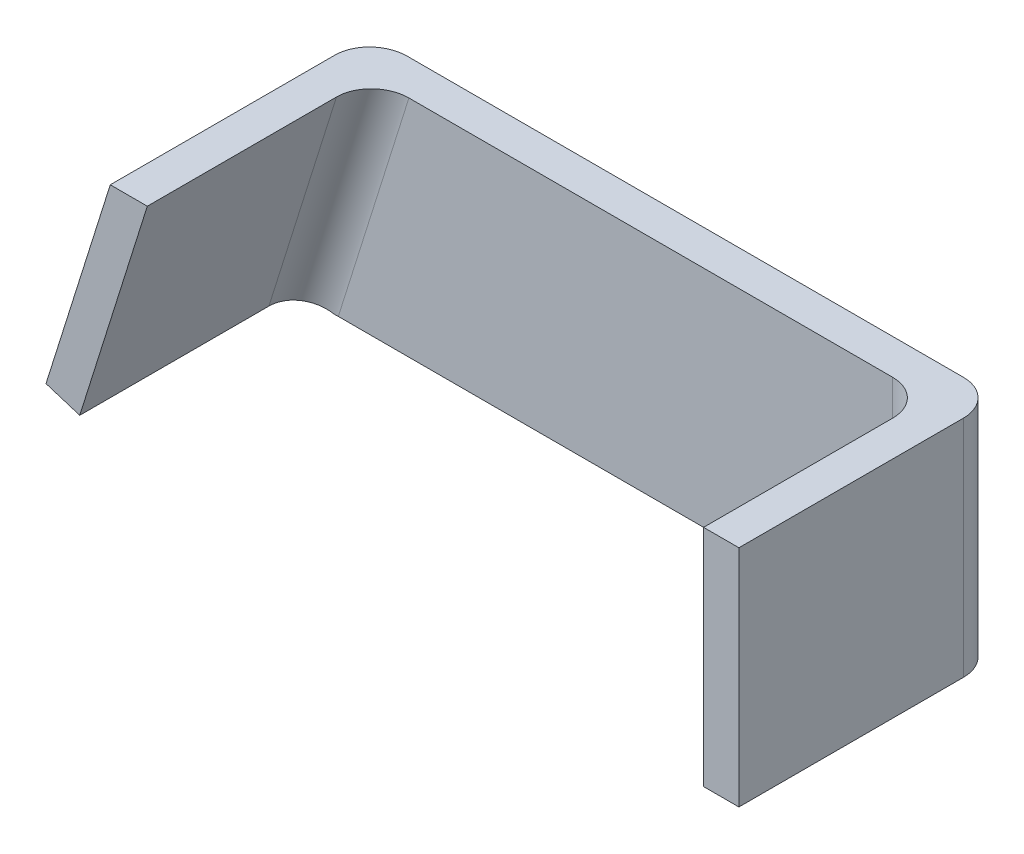
ISO-10303-21;
HEADER;
FILE_DESCRIPTION(('STEP AP214'),'2;1');
FILE_NAME('part.step','',(''),(''),'','','');
FILE_SCHEMA(('AUTOMOTIVE_DESIGN { 1 0 10303 214 1 1 1 1 }'));
ENDSEC;
DATA;
#1=APPLICATION_CONTEXT('core data for automotive mechanical design processes');
#2=APPLICATION_PROTOCOL_DEFINITION('international standard','automotive_design',2000,#1);
#3=PRODUCT_CONTEXT('',#1,'mechanical');
#4=PRODUCT('Part','Part','',(#3));
#5=PRODUCT_RELATED_PRODUCT_CATEGORY('part','',(#4));
#6=PRODUCT_DEFINITION_FORMATION('','',#4);
#7=PRODUCT_DEFINITION_CONTEXT('part definition',#1,'design');
#8=PRODUCT_DEFINITION('design','',#6,#7);
#9=PRODUCT_DEFINITION_SHAPE('','',#8);
#10=(LENGTH_UNIT() NAMED_UNIT(*) SI_UNIT(.MILLI.,.METRE.));
#11=(NAMED_UNIT(*) PLANE_ANGLE_UNIT() SI_UNIT($,.RADIAN.));
#12=(NAMED_UNIT(*) SI_UNIT($,.STERADIAN.) SOLID_ANGLE_UNIT());
#13=UNCERTAINTY_MEASURE_WITH_UNIT(LENGTH_MEASURE(1.E-05),#10,'distance_accuracy_value','');
#14=(GEOMETRIC_REPRESENTATION_CONTEXT(3) GLOBAL_UNCERTAINTY_ASSIGNED_CONTEXT((#13)) GLOBAL_UNIT_ASSIGNED_CONTEXT((#10,
#11,#12)) REPRESENTATION_CONTEXT('',''));
#15=CARTESIAN_POINT('',(0.,0.,0.));
#16=DIRECTION('',(0.,0.,1.));
#17=DIRECTION('',(1.,0.,0.));
#18=AXIS2_PLACEMENT_3D('',#15,#16,#17);
#19=CARTESIAN_POINT('',(44.4670417670357,15.875,5.));
#20=DIRECTION('',(-1.,0.,0.));
#21=DIRECTION('',(0.,-1.,0.));
#22=AXIS2_PLACEMENT_3D('',#19,#20,#21);
#23=PLANE('',#22);
#24=DIRECTION('',(0.,0.,-1.));
#25=VECTOR('',#24,1.);
#26=CARTESIAN_POINT('',(44.4670417670356,-15.875,5.));
#27=LINE('',#26,#25);
#28=CARTESIAN_POINT('',(44.4670417670356,-15.875,36.75));
#29=VERTEX_POINT('',#28);
#30=CARTESIAN_POINT('',(44.4670417670356,-15.875,5.));
#31=VERTEX_POINT('',#30);
#32=EDGE_CURVE('E186',#29,#31,#27,.T.);
#33=ORIENTED_EDGE('',*,*,#32,.T.);
#34=DIRECTION('',(0.,1.,0.));
#35=VECTOR('',#34,1.);
#36=CARTESIAN_POINT('',(44.4670417670357,15.875,5.));
#37=LINE('',#36,#35);
#38=CARTESIAN_POINT('',(44.4670417670357,15.875,5.));
#39=VERTEX_POINT('',#38);
#40=EDGE_CURVE('E210',#31,#39,#37,.T.);
#41=ORIENTED_EDGE('',*,*,#40,.T.);
#42=DIRECTION('',(0.,0.,-1.));
#43=VECTOR('',#42,1.);
#44=CARTESIAN_POINT('',(44.4670417670357,15.875,5.));
#45=LINE('',#44,#43);
#46=CARTESIAN_POINT('',(44.4670417670357,15.875,36.75));
#47=VERTEX_POINT('',#46);
#48=EDGE_CURVE('E198',#47,#39,#45,.T.);
#49=ORIENTED_EDGE('',*,*,#48,.F.);
#50=DIRECTION('',(0.,1.,0.));
#51=VECTOR('',#50,1.);
#52=CARTESIAN_POINT('',(44.4670417670357,15.875,36.75));
#53=LINE('',#52,#51);
#54=EDGE_CURVE('E175',#29,#47,#53,.T.);
#55=ORIENTED_EDGE('',*,*,#54,.F.);
#56=EDGE_LOOP('',(#33,#41,#49,#55));
#57=FACE_BOUND('',#56,.T.);
#58=ADVANCED_FACE('F39',(#57),#23,.F.);
#59=CARTESIAN_POINT('',(-44.4329582329643,15.875,5.));
#60=DIRECTION('',(0.,-1.,0.));
#61=DIRECTION('',(1.,0.,0.));
#62=AXIS2_PLACEMENT_3D('',#59,#60,#61);
#63=PLANE('',#62);
#64=ORIENTED_EDGE('',*,*,#48,.T.);
#65=CARTESIAN_POINT('',(39.4670417670357,15.875,5.));
#66=DIRECTION('',(0.,-1.,0.));
#67=DIRECTION('',(1.,0.,0.));
#68=AXIS2_PLACEMENT_3D('',#65,#66,#67);
#69=CIRCLE('',#68,5.);
#70=CARTESIAN_POINT('',(39.4670417670357,15.875,0.));
#71=VERTEX_POINT('',#70);
#72=EDGE_CURVE('E213',#39,#71,#69,.F.);
#73=ORIENTED_EDGE('',*,*,#72,.T.);
#74=DIRECTION('',(-1.,0.,0.));
#75=VECTOR('',#74,1.);
#76=CARTESIAN_POINT('',(-44.4329582329643,15.875,0.));
#77=LINE('',#76,#75);
#78=CARTESIAN_POINT('',(-39.1915340493547,15.875,0.));
#79=VERTEX_POINT('',#78);
#80=EDGE_CURVE('E157',#71,#79,#77,.T.);
#81=ORIENTED_EDGE('',*,*,#80,.T.);
#82=CARTESIAN_POINT('',(-39.1915340493547,15.875,5.));
#83=DIRECTION('',(0.,-1.,0.));
#84=DIRECTION('',(-1.,0.,0.));
#85=AXIS2_PLACEMENT_3D('',#82,#83,#84);
#86=ELLIPSE('',#85,5.24142418360958,5.);
#87=CARTESIAN_POINT('',(-44.4329582329643,15.875,5.));
#88=VERTEX_POINT('',#87);
#89=EDGE_CURVE('E208',#79,#88,#86,.F.);
#90=ORIENTED_EDGE('',*,*,#89,.T.);
#91=DIRECTION('',(0.,0.,-1.));
#92=VECTOR('',#91,1.);
#93=CARTESIAN_POINT('',(-44.4329582329643,15.875,5.));
#94=LINE('',#93,#92);
#95=CARTESIAN_POINT('',(-44.4329582329643,15.875,36.75));
#96=VERTEX_POINT('',#95);
#97=EDGE_CURVE('E139',#96,#88,#94,.T.);
#98=ORIENTED_EDGE('',*,*,#97,.F.);
#99=DIRECTION('',(-1.,0.,0.));
#100=VECTOR('',#99,1.);
#101=CARTESIAN_POINT('',(-44.4329582329643,15.875,36.75));
#102=LINE('',#101,#100);
#103=CARTESIAN_POINT('',(-39.1915340493547,15.875,36.75));
#104=VERTEX_POINT('',#103);
#105=EDGE_CURVE('E132',#104,#96,#102,.T.);
#106=ORIENTED_EDGE('',*,*,#105,.F.);
#107=DIRECTION('',(0.,0.,-1.));
#108=VECTOR('',#107,1.);
#109=CARTESIAN_POINT('',(-39.1915340493547,15.875,36.75));
#110=LINE('',#109,#108);
#111=CARTESIAN_POINT('',(-39.1915340493547,15.875,10.));
#112=VERTEX_POINT('',#111);
#113=EDGE_CURVE('E137',#104,#112,#110,.T.);
#114=ORIENTED_EDGE('',*,*,#113,.T.);
#115=CARTESIAN_POINT('',(-33.9501098657451,15.875,10.));
#116=DIRECTION('',(0.,-1.,0.));
#117=DIRECTION('',(1.,0.,0.));
#118=AXIS2_PLACEMENT_3D('',#115,#116,#117);
#119=ELLIPSE('',#118,5.24142418360958,5.);
#120=CARTESIAN_POINT('',(-33.9501098657451,15.875,5.));
#121=VERTEX_POINT('',#120);
#122=EDGE_CURVE('E231',#112,#121,#119,.T.);
#123=ORIENTED_EDGE('',*,*,#122,.T.);
#124=DIRECTION('',(-1.,0.,0.));
#125=VECTOR('',#124,1.);
#126=CARTESIAN_POINT('',(-44.4329582329643,15.875,5.));
#127=LINE('',#126,#125);
#128=CARTESIAN_POINT('',(34.4670417670356,15.875,5.));
#129=VERTEX_POINT('',#128);
#130=EDGE_CURVE('E180',#129,#121,#127,.T.);
#131=ORIENTED_EDGE('',*,*,#130,.F.);
#132=CARTESIAN_POINT('',(34.4670417670356,15.875,10.));
#133=DIRECTION('',(0.,-1.,0.));
#134=DIRECTION('',(1.,0.,0.));
#135=AXIS2_PLACEMENT_3D('',#132,#133,#134);
#136=CIRCLE('',#135,5.);
#137=CARTESIAN_POINT('',(39.4670417670356,15.875,10.));
#138=VERTEX_POINT('',#137);
#139=EDGE_CURVE('E229',#129,#138,#136,.T.);
#140=ORIENTED_EDGE('',*,*,#139,.T.);
#141=DIRECTION('',(0.,0.,-1.));
#142=VECTOR('',#141,1.);
#143=CARTESIAN_POINT('',(39.4670417670356,15.875,36.75));
#144=LINE('',#143,#142);
#145=CARTESIAN_POINT('',(39.4670417670356,15.875,36.75));
#146=VERTEX_POINT('',#145);
#147=EDGE_CURVE('E165',#146,#138,#144,.T.);
#148=ORIENTED_EDGE('',*,*,#147,.F.);
#149=DIRECTION('',(-1.,0.,0.));
#150=VECTOR('',#149,1.);
#151=CARTESIAN_POINT('',(39.4670417670356,15.875,36.75));
#152=LINE('',#151,#150);
#153=EDGE_CURVE('E173',#47,#146,#152,.T.);
#154=ORIENTED_EDGE('',*,*,#153,.F.);
#155=EDGE_LOOP('',(#64,#73,#81,#90,#98,#106,#114,#123,#131,#140,#148,#154));
#156=FACE_BOUND('',#155,.T.);
#157=ADVANCED_FACE('F135',(#156),#63,.F.);
#158=CARTESIAN_POINT('',(-44.4329582329643,15.875,5.));
#159=DIRECTION('',(0.953939201416948,-0.299999999999992,0.));
#160=DIRECTION('',(0.299999999999992,0.953939201416948,0.));
#161=AXIS2_PLACEMENT_3D('',#158,#159,#160);
#162=PLANE('',#161);
#163=ORIENTED_EDGE('',*,*,#97,.T.);
#164=DIRECTION('',(-0.299999999999992,-0.953939201416948,0.));
#165=VECTOR('',#164,1.);
#166=CARTESIAN_POINT('',(-44.4329582329643,15.875,5.));
#167=LINE('',#166,#165);
#168=CARTESIAN_POINT('',(-53.5192291264606,-13.0175000000005,5.));
#169=VERTEX_POINT('',#168);
#170=EDGE_CURVE('E200',#88,#169,#167,.T.);
#171=ORIENTED_EDGE('',*,*,#170,.T.);
#172=DIRECTION('',(0.,0.,-1.));
#173=VECTOR('',#172,1.);
#174=CARTESIAN_POINT('',(-53.5192291264606,-13.0175000000005,5.));
#175=LINE('',#174,#173);
#176=CARTESIAN_POINT('',(-53.5192291264606,-13.0175000000005,36.75));
#177=VERTEX_POINT('',#176);
#178=EDGE_CURVE('E194',#177,#169,#175,.T.);
#179=ORIENTED_EDGE('',*,*,#178,.F.);
#180=DIRECTION('',(-0.299999999999992,-0.953939201416948,0.));
#181=VECTOR('',#180,1.);
#182=CARTESIAN_POINT('',(-53.5192291264606,-13.0175000000005,36.75));
#183=LINE('',#182,#181);
#184=EDGE_CURVE('E143',#96,#177,#183,.T.);
#185=ORIENTED_EDGE('',*,*,#184,.F.);
#186=EDGE_LOOP('',(#163,#171,#179,#185));
#187=FACE_BOUND('',#186,.T.);
#188=ADVANCED_FACE('F272',(#187),#162,.F.);
#189=CARTESIAN_POINT('',(-44.4329582329642,-15.8750000000004,5.));
#190=DIRECTION('',(0.299999999999997,0.953939201416947,0.));
#191=DIRECTION('',(-0.953939201416947,0.299999999999997,0.));
#192=AXIS2_PLACEMENT_3D('',#189,#190,#191);
#193=PLANE('',#192);
#194=ORIENTED_EDGE('',*,*,#178,.T.);
#195=CARTESIAN_POINT('',(-48.7495331193758,-14.5175000000005,5.));
#196=DIRECTION('',(0.299999999999997,0.953939201416947,0.));
#197=DIRECTION('',(-0.953939201416947,0.299999999999997,0.));
#198=AXIS2_PLACEMENT_3D('',#195,#196,#197);
#199=CIRCLE('',#198,5.);
#200=CARTESIAN_POINT('',(-48.7495331193758,-14.5175000000005,0.));
#201=VERTEX_POINT('',#200);
#202=EDGE_CURVE('E203',#169,#201,#199,.F.);
#203=ORIENTED_EDGE('',*,*,#202,.T.);
#204=DIRECTION('',(0.953939201416947,-0.299999999999997,0.));
#205=VECTOR('',#204,1.);
#206=CARTESIAN_POINT('',(-44.4329582329642,-15.8750000000004,0.));
#207=LINE('',#206,#205);
#208=CARTESIAN_POINT('',(-44.4329582329642,-15.8750000000004,0.));
#209=VERTEX_POINT('',#208);
#210=EDGE_CURVE('E160',#201,#209,#207,.T.);
#211=ORIENTED_EDGE('',*,*,#210,.T.);
#212=DIRECTION('',(0.,0.,-1.));
#213=VECTOR('',#212,1.);
#214=CARTESIAN_POINT('',(-44.4329582329642,-15.8750000000004,5.));
#215=LINE('',#214,#213);
#216=CARTESIAN_POINT('',(-44.4329582329642,-15.8750000000004,5.02261363766083));
#217=VERTEX_POINT('',#216);
#218=EDGE_CURVE('E53',#217,#209,#215,.T.);
#219=ORIENTED_EDGE('',*,*,#218,.F.);
#220=CARTESIAN_POINT('',(-43.9798371122911,-16.0175000000004,10.));
#221=DIRECTION('',(0.299999999999997,0.953939201416947,0.));
#222=DIRECTION('',(-0.953939201416947,0.299999999999997,0.));
#223=AXIS2_PLACEMENT_3D('',#220,#221,#222);
#224=CIRCLE('',#223,5.);
#225=CARTESIAN_POINT('',(-48.7495331193758,-14.5175000000004,10.));
#226=VERTEX_POINT('',#225);
#227=EDGE_CURVE('E11',#217,#226,#224,.T.);
#228=ORIENTED_EDGE('',*,*,#227,.T.);
#229=DIRECTION('',(0.,0.,-1.));
#230=VECTOR('',#229,1.);
#231=CARTESIAN_POINT('',(-48.7495331193758,-14.5175000000004,36.75));
#232=LINE('',#231,#230);
#233=CARTESIAN_POINT('',(-48.7495331193758,-14.5175000000004,36.75));
#234=VERTEX_POINT('',#233);
#235=EDGE_CURVE('E158',#234,#226,#232,.T.);
#236=ORIENTED_EDGE('',*,*,#235,.F.);
#237=DIRECTION('',(0.953939201416948,-0.299999999999992,0.));
#238=VECTOR('',#237,1.);
#239=CARTESIAN_POINT('',(-48.7495331193758,-14.5175000000004,36.75));
#240=LINE('',#239,#238);
#241=EDGE_CURVE('E149',#177,#234,#240,.T.);
#242=ORIENTED_EDGE('',*,*,#241,.F.);
#243=EDGE_LOOP('',(#194,#203,#211,#219,#228,#236,#242));
#244=FACE_BOUND('',#243,.T.);
#245=ADVANCED_FACE('F274',(#244),#193,.F.);
#246=CARTESIAN_POINT('',(-44.4329582329642,-15.8750000000004,5.));
#247=DIRECTION('',(0.,1.,0.));
#248=DIRECTION('',(-1.,0.,0.));
#249=AXIS2_PLACEMENT_3D('',#246,#247,#248);
#250=PLANE('',#249);
#251=DIRECTION('',(1.,0.,0.));
#252=VECTOR('',#251,1.);
#253=CARTESIAN_POINT('',(-44.4329582329642,-15.8750000000004,0.));
#254=LINE('',#253,#252);
#255=CARTESIAN_POINT('',(39.4670417670356,-15.875,0.));
#256=VERTEX_POINT('',#255);
#257=EDGE_CURVE('E184',#209,#256,#254,.T.);
#258=ORIENTED_EDGE('',*,*,#257,.T.);
#259=CARTESIAN_POINT('',(39.4670417670356,-15.875,5.));
#260=DIRECTION('',(0.,1.,0.));
#261=DIRECTION('',(-1.,0.,0.));
#262=AXIS2_PLACEMENT_3D('',#259,#260,#261);
#263=CIRCLE('',#262,5.);
#264=EDGE_CURVE('E217',#256,#31,#263,.F.);
#265=ORIENTED_EDGE('',*,*,#264,.T.);
#266=ORIENTED_EDGE('',*,*,#32,.F.);
#267=DIRECTION('',(1.,0.,0.));
#268=VECTOR('',#267,1.);
#269=CARTESIAN_POINT('',(44.4670417670356,-15.875,36.75));
#270=LINE('',#269,#268);
#271=CARTESIAN_POINT('',(39.4670417670356,-15.8750000000004,36.75));
#272=VERTEX_POINT('',#271);
#273=EDGE_CURVE('E151',#272,#29,#270,.T.);
#274=ORIENTED_EDGE('',*,*,#273,.F.);
#275=DIRECTION('',(0.,0.,-1.));
#276=VECTOR('',#275,1.);
#277=CARTESIAN_POINT('',(39.4670417670356,-15.8750000000004,36.75));
#278=LINE('',#277,#276);
#279=CARTESIAN_POINT('',(39.4670417670356,-15.8750000000004,10.));
#280=VERTEX_POINT('',#279);
#281=EDGE_CURVE('E168',#272,#280,#278,.T.);
#282=ORIENTED_EDGE('',*,*,#281,.T.);
#283=CARTESIAN_POINT('',(34.4670417670356,-15.875,10.));
#284=DIRECTION('',(0.,1.,0.));
#285=DIRECTION('',(-1.,0.,0.));
#286=AXIS2_PLACEMENT_3D('',#283,#284,#285);
#287=CIRCLE('',#286,5.);
#288=CARTESIAN_POINT('',(34.4670417670356,-15.875,5.));
#289=VERTEX_POINT('',#288);
#290=EDGE_CURVE('E227',#280,#289,#287,.T.);
#291=ORIENTED_EDGE('',*,*,#290,.T.);
#292=DIRECTION('',(1.,0.,0.));
#293=VECTOR('',#292,1.);
#294=CARTESIAN_POINT('',(-44.4329582329642,-15.8750000000004,5.));
#295=LINE('',#294,#293);
#296=CARTESIAN_POINT('',(-43.9350229355213,-15.8750000000004,5.));
#297=VERTEX_POINT('',#296);
#298=EDGE_CURVE('E183',#297,#289,#295,.T.);
#299=ORIENTED_EDGE('',*,*,#298,.F.);
#300=CARTESIAN_POINT('',(-43.9350229355213,-15.8750000000004,10.));
#301=DIRECTION('',(0.,1.,0.));
#302=DIRECTION('',(1.,0.,0.));
#303=AXIS2_PLACEMENT_3D('',#300,#301,#302);
#304=ELLIPSE('',#303,5.24142418360959,5.);
#305=EDGE_CURVE('E47',#297,#217,#304,.T.);
#306=ORIENTED_EDGE('',*,*,#305,.T.);
#307=ORIENTED_EDGE('',*,*,#218,.T.);
#308=EDGE_LOOP('',(#258,#265,#266,#274,#282,#291,#299,#306,#307));
#309=FACE_BOUND('',#308,.T.);
#310=ADVANCED_FACE('F235',(#309),#250,.F.);
#311=CARTESIAN_POINT('',(0.,0.,5.));
#312=DIRECTION('',(0.,0.,1.));
#313=DIRECTION('',(1.,0.,0.));
#314=AXIS2_PLACEMENT_3D('',#311,#312,#313);
#315=PLANE('',#314);
#316=ORIENTED_EDGE('',*,*,#298,.T.);
#317=DIRECTION('',(0.,-1.,0.));
#318=VECTOR('',#317,1.);
#319=CARTESIAN_POINT('',(34.4670417670356,0.,5.));
#320=LINE('',#319,#318);
#321=EDGE_CURVE('E224',#289,#129,#320,.F.);
#322=ORIENTED_EDGE('',*,*,#321,.T.);
#323=ORIENTED_EDGE('',*,*,#130,.T.);
#324=DIRECTION('',(0.299999999999992,0.953939201416948,0.));
#325=VECTOR('',#324,1.);
#326=CARTESIAN_POINT('',(-35.4377354245763,11.1446522080036,5.));
#327=LINE('',#326,#325);
#328=EDGE_CURVE('E222',#121,#297,#327,.F.);
#329=ORIENTED_EDGE('',*,*,#328,.T.);
#330=EDGE_LOOP('',(#316,#322,#323,#329));
#331=FACE_BOUND('',#330,.T.);
#332=ADVANCED_FACE('F242',(#331),#315,.T.);
#333=CARTESIAN_POINT('',(0.,0.,0.));
#334=DIRECTION('',(0.,0.,1.));
#335=DIRECTION('',(1.,0.,0.));
#336=AXIS2_PLACEMENT_3D('',#333,#334,#335);
#337=PLANE('',#336);
#338=ORIENTED_EDGE('',*,*,#80,.F.);
#339=DIRECTION('',(0.,1.,0.));
#340=VECTOR('',#339,1.);
#341=CARTESIAN_POINT('',(39.4670417670357,-1.20756113931197E-13,0.));
#342=LINE('',#341,#340);
#343=EDGE_CURVE('E215',#71,#256,#342,.F.);
#344=ORIENTED_EDGE('',*,*,#343,.T.);
#345=ORIENTED_EDGE('',*,*,#257,.F.);
#346=ORIENTED_EDGE('',*,*,#210,.F.);
#347=DIRECTION('',(-0.299999999999992,-0.953939201416948,0.));
#348=VECTOR('',#347,1.);
#349=CARTESIAN_POINT('',(-40.2074314316611,12.6446522080036,0.));
#350=LINE('',#349,#348);
#351=EDGE_CURVE('E205',#201,#79,#350,.F.);
#352=ORIENTED_EDGE('',*,*,#351,.T.);
#353=EDGE_LOOP('',(#338,#344,#345,#346,#352));
#354=FACE_BOUND('',#353,.T.);
#355=ADVANCED_FACE('F265',(#354),#337,.F.);
#356=CARTESIAN_POINT('',(39.4670417670356,-15.8750000000004,36.75));
#357=DIRECTION('',(1.,0.,0.));
#358=DIRECTION('',(0.,0.,-1.));
#359=AXIS2_PLACEMENT_3D('',#356,#357,#358);
#360=PLANE('',#359);
#361=ORIENTED_EDGE('',*,*,#147,.T.);
#362=DIRECTION('',(0.,-1.,0.));
#363=VECTOR('',#362,1.);
#364=CARTESIAN_POINT('',(39.4670417670356,-15.8750000000004,10.));
#365=LINE('',#364,#363);
#366=EDGE_CURVE('E219',#138,#280,#365,.T.);
#367=ORIENTED_EDGE('',*,*,#366,.T.);
#368=ORIENTED_EDGE('',*,*,#281,.F.);
#369=DIRECTION('',(0.,-1.,0.));
#370=VECTOR('',#369,1.);
#371=CARTESIAN_POINT('',(39.4670417670356,-15.8750000000004,36.75));
#372=LINE('',#371,#370);
#373=EDGE_CURVE('E171',#146,#272,#372,.T.);
#374=ORIENTED_EDGE('',*,*,#373,.F.);
#375=EDGE_LOOP('',(#361,#367,#368,#374));
#376=FACE_BOUND('',#375,.T.);
#377=ADVANCED_FACE('F251',(#376),#360,.F.);
#378=CARTESIAN_POINT('',(0.,0.,36.75));
#379=DIRECTION('',(0.,0.,-1.));
#380=DIRECTION('',(-1.,0.,0.));
#381=AXIS2_PLACEMENT_3D('',#378,#379,#380);
#382=PLANE('',#381);
#383=ORIENTED_EDGE('',*,*,#273,.T.);
#384=ORIENTED_EDGE('',*,*,#54,.T.);
#385=ORIENTED_EDGE('',*,*,#153,.T.);
#386=ORIENTED_EDGE('',*,*,#373,.T.);
#387=EDGE_LOOP('',(#383,#384,#385,#386));
#388=FACE_BOUND('',#387,.T.);
#389=ADVANCED_FACE('F255',(#388),#382,.F.);
#390=CARTESIAN_POINT('',(-48.7495331193758,-14.5175000000004,36.75));
#391=DIRECTION('',(-0.953939201416948,0.299999999999992,0.));
#392=DIRECTION('',(-0.299999999999992,-0.953939201416948,0.));
#393=AXIS2_PLACEMENT_3D('',#390,#391,#392);
#394=PLANE('',#393);
#395=ORIENTED_EDGE('',*,*,#235,.T.);
#396=DIRECTION('',(0.299999999999992,0.953939201416948,0.));
#397=VECTOR('',#396,1.);
#398=CARTESIAN_POINT('',(-48.7495331193758,-14.5175000000004,10.));
#399=LINE('',#398,#397);
#400=EDGE_CURVE('E156',#226,#112,#399,.T.);
#401=ORIENTED_EDGE('',*,*,#400,.T.);
#402=ORIENTED_EDGE('',*,*,#113,.F.);
#403=DIRECTION('',(0.299999999999992,0.953939201416948,0.));
#404=VECTOR('',#403,1.);
#405=CARTESIAN_POINT('',(-48.7495331193758,-14.5175000000004,36.75));
#406=LINE('',#405,#404);
#407=EDGE_CURVE('E144',#234,#104,#406,.T.);
#408=ORIENTED_EDGE('',*,*,#407,.F.);
#409=EDGE_LOOP('',(#395,#401,#402,#408));
#410=FACE_BOUND('',#409,.T.);
#411=ADVANCED_FACE('F154',(#410),#394,.F.);
#412=CARTESIAN_POINT('',(0.,0.,36.75));
#413=DIRECTION('',(0.,0.,1.));
#414=DIRECTION('',(1.,0.,0.));
#415=AXIS2_PLACEMENT_3D('',#412,#413,#414);
#416=PLANE('',#415);
#417=ORIENTED_EDGE('',*,*,#407,.T.);
#418=ORIENTED_EDGE('',*,*,#105,.T.);
#419=ORIENTED_EDGE('',*,*,#184,.T.);
#420=ORIENTED_EDGE('',*,*,#241,.T.);
#421=EDGE_LOOP('',(#417,#418,#419,#420));
#422=FACE_BOUND('',#421,.T.);
#423=ADVANCED_FACE('F147',(#422),#416,.T.);
#424=CARTESIAN_POINT('',(-39.6632622258795,14.3750000000001,5.));
#425=DIRECTION('',(-0.299999999999992,-0.953939201416948,0.));
#426=DIRECTION('',(0.953939201416948,-0.299999999999992,0.));
#427=AXIS2_PLACEMENT_3D('',#424,#425,#426);
#428=CYLINDRICAL_SURFACE('',#427,5.);
#429=ORIENTED_EDGE('',*,*,#89,.F.);
#430=ORIENTED_EDGE('',*,*,#351,.F.);
#431=ORIENTED_EDGE('',*,*,#202,.F.);
#432=ORIENTED_EDGE('',*,*,#170,.F.);
#433=EDGE_LOOP('',(#429,#430,#431,#432));
#434=FACE_BOUND('',#433,.T.);
#435=ADVANCED_FACE('F273',(#434),#428,.T.);
#436=CARTESIAN_POINT('',(39.4670417670357,15.875,5.));
#437=DIRECTION('',(0.,1.,0.));
#438=DIRECTION('',(-1.,0.,0.));
#439=AXIS2_PLACEMENT_3D('',#436,#437,#438);
#440=CYLINDRICAL_SURFACE('',#439,5.);
#441=ORIENTED_EDGE('',*,*,#264,.F.);
#442=ORIENTED_EDGE('',*,*,#343,.F.);
#443=ORIENTED_EDGE('',*,*,#72,.F.);
#444=ORIENTED_EDGE('',*,*,#40,.F.);
#445=EDGE_LOOP('',(#441,#442,#443,#444));
#446=FACE_BOUND('',#445,.T.);
#447=ADVANCED_FACE('F262',(#446),#440,.T.);
#448=CARTESIAN_POINT('',(34.4670417670356,-15.8750000000004,10.));
#449=DIRECTION('',(0.,-1.,0.));
#450=DIRECTION('',(0.,0.,-1.));
#451=AXIS2_PLACEMENT_3D('',#448,#449,#450);
#452=CYLINDRICAL_SURFACE('',#451,5.);
#453=ORIENTED_EDGE('',*,*,#139,.F.);
#454=ORIENTED_EDGE('',*,*,#321,.F.);
#455=ORIENTED_EDGE('',*,*,#290,.F.);
#456=ORIENTED_EDGE('',*,*,#366,.F.);
#457=EDGE_LOOP('',(#453,#454,#455,#456));
#458=FACE_BOUND('',#457,.T.);
#459=ADVANCED_FACE('F245',(#458),#452,.F.);
#460=CARTESIAN_POINT('',(-43.9798371122911,-16.0175000000004,10.));
#461=DIRECTION('',(0.299999999999992,0.953939201416948,0.));
#462=DIRECTION('',(-0.953939201416948,0.299999999999992,0.));
#463=AXIS2_PLACEMENT_3D('',#460,#461,#462);
#464=CYLINDRICAL_SURFACE('',#463,5.);
#465=ORIENTED_EDGE('',*,*,#305,.F.);
#466=ORIENTED_EDGE('',*,*,#328,.F.);
#467=ORIENTED_EDGE('',*,*,#122,.F.);
#468=ORIENTED_EDGE('',*,*,#400,.F.);
#469=ORIENTED_EDGE('',*,*,#227,.F.);
#470=EDGE_LOOP('',(#465,#466,#467,#468,#469));
#471=FACE_BOUND('',#470,.T.);
#472=ADVANCED_FACE('F41',(#471),#464,.F.);
#473=CLOSED_SHELL('',(#58,#157,#188,#245,#310,#332,#355,#377,#389,#411,#423,#435,#447,#459,#472));
#474=MANIFOLD_SOLID_BREP('B2',#473);
#475=ADVANCED_BREP_SHAPE_REPRESENTATION('',(#18,#474),#14);
#476=SHAPE_DEFINITION_REPRESENTATION(#9,#475);
ENDSEC;
END-ISO-10303-21;
